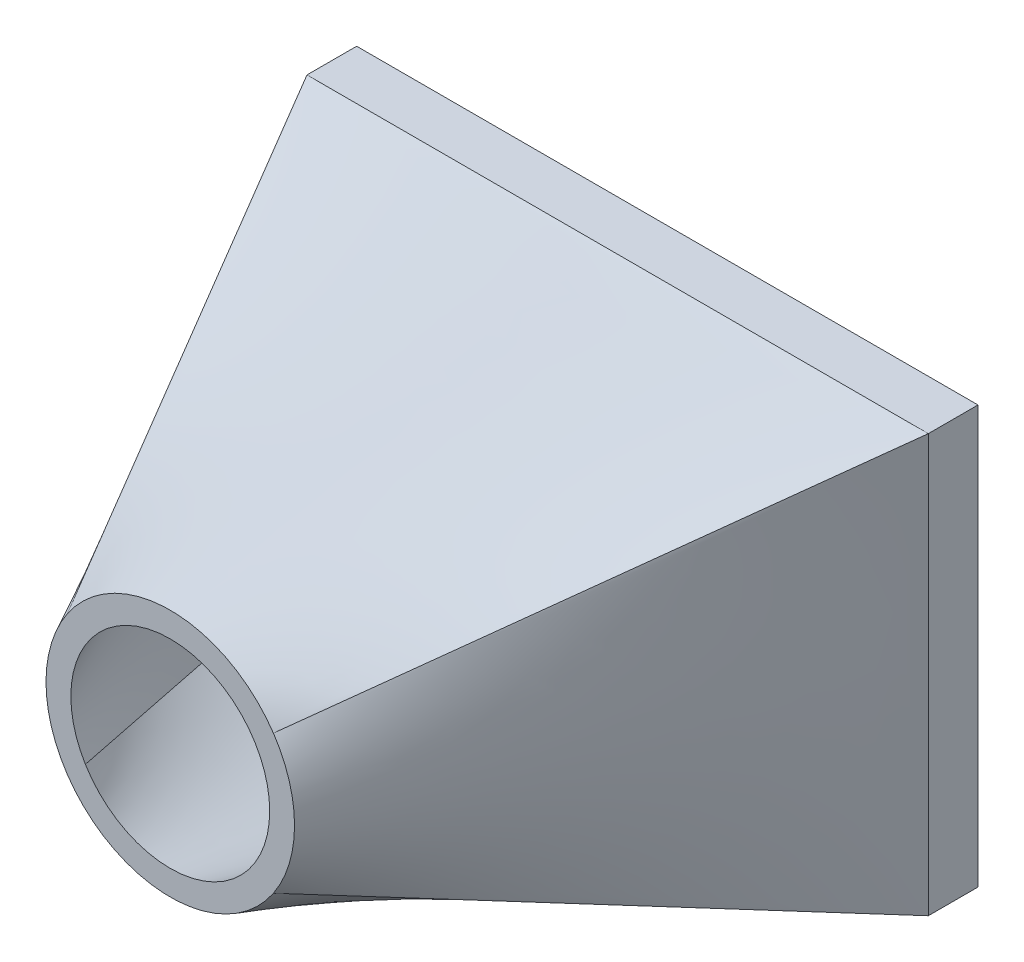
ISO-10303-21;
HEADER;
FILE_DESCRIPTION(('STEP AP214'),'2;1');
FILE_NAME('part.step','',(''),(''),'','','');
FILE_SCHEMA(('AUTOMOTIVE_DESIGN { 1 0 10303 214 1 1 1 1 }'));
ENDSEC;
DATA;
#1=APPLICATION_CONTEXT('core data for automotive mechanical design processes');
#2=APPLICATION_PROTOCOL_DEFINITION('international standard','automotive_design',2000,#1);
#3=PRODUCT_CONTEXT('',#1,'mechanical');
#4=PRODUCT('Part','Part','',(#3));
#5=PRODUCT_RELATED_PRODUCT_CATEGORY('part','',(#4));
#6=PRODUCT_DEFINITION_FORMATION('','',#4);
#7=PRODUCT_DEFINITION_CONTEXT('part definition',#1,'design');
#8=PRODUCT_DEFINITION('design','',#6,#7);
#9=PRODUCT_DEFINITION_SHAPE('','',#8);
#10=(LENGTH_UNIT() NAMED_UNIT(*) SI_UNIT(.MILLI.,.METRE.));
#11=(NAMED_UNIT(*) PLANE_ANGLE_UNIT() SI_UNIT($,.RADIAN.));
#12=(NAMED_UNIT(*) SI_UNIT($,.STERADIAN.) SOLID_ANGLE_UNIT());
#13=UNCERTAINTY_MEASURE_WITH_UNIT(LENGTH_MEASURE(1.E-05),#10,'distance_accuracy_value','');
#14=(GEOMETRIC_REPRESENTATION_CONTEXT(3) GLOBAL_UNCERTAINTY_ASSIGNED_CONTEXT((#13)) GLOBAL_UNIT_ASSIGNED_CONTEXT((#10,
#11,#12)) REPRESENTATION_CONTEXT('',''));
#15=CARTESIAN_POINT('',(0.,0.,0.));
#16=DIRECTION('',(0.,0.,1.));
#17=DIRECTION('',(1.,0.,0.));
#18=AXIS2_PLACEMENT_3D('',#15,#16,#17);
#19=CARTESIAN_POINT('',(0.,0.,0.));
#20=DIRECTION('',(0.,0.,1.));
#21=DIRECTION('',(1.,0.,0.));
#22=AXIS2_PLACEMENT_3D('',#19,#20,#21);
#23=PLANE('',#22);
#24=DIRECTION('',(1.,0.,0.));
#25=VECTOR('',#24,1.);
#26=CARTESIAN_POINT('',(-6.25,-4.2,0.));
#27=LINE('',#26,#25);
#28=CARTESIAN_POINT('',(-6.25,-4.2,0.));
#29=VERTEX_POINT('',#28);
#30=CARTESIAN_POINT('',(6.25,-4.2,0.));
#31=VERTEX_POINT('',#30);
#32=EDGE_CURVE('E370',#29,#31,#27,.T.);
#33=ORIENTED_EDGE('',*,*,#32,.F.);
#34=DIRECTION('',(0.,-1.,0.));
#35=VECTOR('',#34,1.);
#36=CARTESIAN_POINT('',(-6.25,-4.2,0.));
#37=LINE('',#36,#35);
#38=CARTESIAN_POINT('',(-6.25,4.2,0.));
#39=VERTEX_POINT('',#38);
#40=EDGE_CURVE('E427',#39,#29,#37,.T.);
#41=ORIENTED_EDGE('',*,*,#40,.F.);
#42=DIRECTION('',(-1.,0.,0.));
#43=VECTOR('',#42,1.);
#44=CARTESIAN_POINT('',(-6.25,4.2,0.));
#45=LINE('',#44,#43);
#46=CARTESIAN_POINT('',(6.25,4.2,0.));
#47=VERTEX_POINT('',#46);
#48=EDGE_CURVE('E424',#47,#39,#45,.T.);
#49=ORIENTED_EDGE('',*,*,#48,.F.);
#50=DIRECTION('',(0.,1.,0.));
#51=VECTOR('',#50,1.);
#52=CARTESIAN_POINT('',(6.25,-4.2,0.));
#53=LINE('',#52,#51);
#54=EDGE_CURVE('E156',#31,#47,#53,.T.);
#55=ORIENTED_EDGE('',*,*,#54,.F.);
#56=EDGE_LOOP('',(#33,#41,#49,#55));
#57=FACE_BOUND('',#56,.T.);
#58=DIRECTION('',(0.,1.,0.));
#59=VECTOR('',#58,1.);
#60=CARTESIAN_POINT('',(5.25,-3.2,0.));
#61=LINE('',#60,#59);
#62=CARTESIAN_POINT('',(5.25,-3.2,0.));
#63=VERTEX_POINT('',#62);
#64=CARTESIAN_POINT('',(5.25,3.2,0.));
#65=VERTEX_POINT('',#64);
#66=EDGE_CURVE('E401',#63,#65,#61,.T.);
#67=ORIENTED_EDGE('',*,*,#66,.T.);
#68=DIRECTION('',(-1.,0.,0.));
#69=VECTOR('',#68,1.);
#70=CARTESIAN_POINT('',(-5.25,3.2,0.));
#71=LINE('',#70,#69);
#72=CARTESIAN_POINT('',(-5.25,3.2,0.));
#73=VERTEX_POINT('',#72);
#74=EDGE_CURVE('E406',#65,#73,#71,.T.);
#75=ORIENTED_EDGE('',*,*,#74,.T.);
#76=DIRECTION('',(0.,-1.,0.));
#77=VECTOR('',#76,1.);
#78=CARTESIAN_POINT('',(-5.25,-3.2,0.));
#79=LINE('',#78,#77);
#80=CARTESIAN_POINT('',(-5.25,-3.2,0.));
#81=VERTEX_POINT('',#80);
#82=EDGE_CURVE('E409',#73,#81,#79,.T.);
#83=ORIENTED_EDGE('',*,*,#82,.T.);
#84=DIRECTION('',(1.,0.,0.));
#85=VECTOR('',#84,1.);
#86=CARTESIAN_POINT('',(-5.25,-3.2,0.));
#87=LINE('',#86,#85);
#88=EDGE_CURVE('E416',#81,#63,#87,.T.);
#89=ORIENTED_EDGE('',*,*,#88,.T.);
#90=EDGE_LOOP('',(#67,#75,#83,#89));
#91=FACE_BOUND('',#90,.T.);
#92=ADVANCED_FACE('F97',(#57,#91),#23,.F.);
#93=CARTESIAN_POINT('',(-6.25,-4.2,1.));
#94=DIRECTION('',(0.,1.,0.));
#95=DIRECTION('',(0.,0.,1.));
#96=AXIS2_PLACEMENT_3D('',#93,#94,#95);
#97=PLANE('',#96);
#98=ORIENTED_EDGE('',*,*,#32,.T.);
#99=DIRECTION('',(0.,0.,-1.));
#100=VECTOR('',#99,1.);
#101=CARTESIAN_POINT('',(6.25,-4.2,1.));
#102=LINE('',#101,#100);
#103=CARTESIAN_POINT('',(6.25,-4.2,1.));
#104=VERTEX_POINT('',#103);
#105=EDGE_CURVE('E12',#104,#31,#102,.T.);
#106=ORIENTED_EDGE('',*,*,#105,.F.);
#107=DIRECTION('',(1.,0.,0.));
#108=VECTOR('',#107,1.);
#109=CARTESIAN_POINT('',(-6.25,-4.2,1.));
#110=LINE('',#109,#108);
#111=CARTESIAN_POINT('',(-6.25,-4.2,1.));
#112=VERTEX_POINT('',#111);
#113=EDGE_CURVE('E185',#112,#104,#110,.T.);
#114=ORIENTED_EDGE('',*,*,#113,.F.);
#115=DIRECTION('',(0.,0.,-1.));
#116=VECTOR('',#115,1.);
#117=CARTESIAN_POINT('',(-6.25,-4.2,1.));
#118=LINE('',#117,#116);
#119=EDGE_CURVE('E431',#112,#29,#118,.T.);
#120=ORIENTED_EDGE('',*,*,#119,.T.);
#121=EDGE_LOOP('',(#98,#106,#114,#120));
#122=FACE_BOUND('',#121,.T.);
#123=ADVANCED_FACE('F99',(#122),#97,.F.);
#124=CARTESIAN_POINT('',(6.25,-4.2,1.));
#125=DIRECTION('',(-1.,0.,0.));
#126=DIRECTION('',(0.,0.,1.));
#127=AXIS2_PLACEMENT_3D('',#124,#125,#126);
#128=PLANE('',#127);
#129=ORIENTED_EDGE('',*,*,#54,.T.);
#130=DIRECTION('',(0.,0.,-1.));
#131=VECTOR('',#130,1.);
#132=CARTESIAN_POINT('',(6.25,4.2,1.));
#133=LINE('',#132,#131);
#134=CARTESIAN_POINT('',(6.25,4.2,0.999999999999999));
#135=VERTEX_POINT('',#134);
#136=EDGE_CURVE('E109',#135,#47,#133,.T.);
#137=ORIENTED_EDGE('',*,*,#136,.F.);
#138=DIRECTION('',(0.,1.,0.));
#139=VECTOR('',#138,1.);
#140=CARTESIAN_POINT('',(6.25,-4.2,1.));
#141=LINE('',#140,#139);
#142=EDGE_CURVE('E152',#104,#135,#141,.T.);
#143=ORIENTED_EDGE('',*,*,#142,.F.);
#144=ORIENTED_EDGE('',*,*,#105,.T.);
#145=EDGE_LOOP('',(#129,#137,#143,#144));
#146=FACE_BOUND('',#145,.T.);
#147=ADVANCED_FACE('F150',(#146),#128,.F.);
#148=CARTESIAN_POINT('',(-6.25,4.2,1.));
#149=DIRECTION('',(0.,-1.,0.));
#150=DIRECTION('',(0.,0.,-1.));
#151=AXIS2_PLACEMENT_3D('',#148,#149,#150);
#152=PLANE('',#151);
#153=ORIENTED_EDGE('',*,*,#48,.T.);
#154=DIRECTION('',(0.,0.,-1.));
#155=VECTOR('',#154,1.);
#156=CARTESIAN_POINT('',(-6.25,4.2,1.));
#157=LINE('',#156,#155);
#158=CARTESIAN_POINT('',(-6.25,4.2,1.));
#159=VERTEX_POINT('',#158);
#160=EDGE_CURVE('E161',#159,#39,#157,.T.);
#161=ORIENTED_EDGE('',*,*,#160,.F.);
#162=DIRECTION('',(1.,0.,0.));
#163=VECTOR('',#162,1.);
#164=CARTESIAN_POINT('',(-6.25,4.2,1.));
#165=LINE('',#164,#163);
#166=EDGE_CURVE('E164',#135,#159,#165,.F.);
#167=ORIENTED_EDGE('',*,*,#166,.F.);
#168=ORIENTED_EDGE('',*,*,#136,.T.);
#169=EDGE_LOOP('',(#153,#161,#167,#168));
#170=FACE_BOUND('',#169,.T.);
#171=ADVANCED_FACE('F165',(#170),#152,.F.);
#172=CARTESIAN_POINT('',(-6.25,-4.2,1.));
#173=DIRECTION('',(1.,0.,0.));
#174=DIRECTION('',(0.,0.,-1.));
#175=AXIS2_PLACEMENT_3D('',#172,#173,#174);
#176=PLANE('',#175);
#177=ORIENTED_EDGE('',*,*,#40,.T.);
#178=ORIENTED_EDGE('',*,*,#119,.F.);
#179=DIRECTION('',(0.,1.,0.));
#180=VECTOR('',#179,1.);
#181=CARTESIAN_POINT('',(-6.25,-4.2,1.));
#182=LINE('',#181,#180);
#183=EDGE_CURVE('E173',#159,#112,#182,.F.);
#184=ORIENTED_EDGE('',*,*,#183,.F.);
#185=ORIENTED_EDGE('',*,*,#160,.T.);
#186=EDGE_LOOP('',(#177,#178,#184,#185));
#187=FACE_BOUND('',#186,.T.);
#188=ADVANCED_FACE('F480',(#187),#176,.F.);
#189=CARTESIAN_POINT('',(5.25,-3.2,1.));
#190=DIRECTION('',(-1.,0.,0.));
#191=DIRECTION('',(0.,0.,1.));
#192=AXIS2_PLACEMENT_3D('',#189,#190,#191);
#193=PLANE('',#192);
#194=ORIENTED_EDGE('',*,*,#66,.F.);
#195=DIRECTION('',(0.,0.,-1.));
#196=VECTOR('',#195,1.);
#197=CARTESIAN_POINT('',(5.25,-3.2,1.));
#198=LINE('',#197,#196);
#199=CARTESIAN_POINT('',(5.25,-3.2,1.));
#200=VERTEX_POINT('',#199);
#201=EDGE_CURVE('E325',#200,#63,#198,.T.);
#202=ORIENTED_EDGE('',*,*,#201,.F.);
#203=CARTESIAN_POINT('',(5.25,3.2,1.));
#204=CARTESIAN_POINT('',(5.25,2.66666666666667,1.));
#205=CARTESIAN_POINT('',(5.25,2.13333333333333,1.));
#206=CARTESIAN_POINT('',(5.25,1.06666666666667,1.));
#207=CARTESIAN_POINT('',(5.25,0.533333333333335,1.));
#208=CARTESIAN_POINT('',(5.25,-0.533333333333332,1.));
#209=CARTESIAN_POINT('',(5.25,-1.06666666666666,1.));
#210=CARTESIAN_POINT('',(5.25,-2.13333333333333,1.));
#211=CARTESIAN_POINT('',(5.25,-2.66666666666667,1.));
#212=CARTESIAN_POINT('',(5.25,-3.2,1.));
#213=B_SPLINE_CURVE_WITH_KNOTS('',3,(#203,#204,#205,#206,#207,#208,#209,#210,#211,#212),
.UNSPECIFIED.,.F.,.F.,(4,2,2,2,4),(0.,0.25,0.5,0.75,1.),.UNSPECIFIED.);
#214=CARTESIAN_POINT('',(5.25,3.2,1.));
#215=VERTEX_POINT('',#214);
#216=EDGE_CURVE('E379',#200,#215,#213,.F.);
#217=ORIENTED_EDGE('',*,*,#216,.T.);
#218=DIRECTION('',(0.,0.,-1.));
#219=VECTOR('',#218,1.);
#220=CARTESIAN_POINT('',(5.25,3.2,1.));
#221=LINE('',#220,#219);
#222=EDGE_CURVE('E361',#215,#65,#221,.T.);
#223=ORIENTED_EDGE('',*,*,#222,.T.);
#224=EDGE_LOOP('',(#194,#202,#217,#223));
#225=FACE_BOUND('',#224,.T.);
#226=ADVANCED_FACE('F351',(#225),#193,.T.);
#227=CARTESIAN_POINT('',(-5.25,3.2,1.));
#228=DIRECTION('',(0.,-1.,0.));
#229=DIRECTION('',(0.,0.,-1.));
#230=AXIS2_PLACEMENT_3D('',#227,#228,#229);
#231=PLANE('',#230);
#232=ORIENTED_EDGE('',*,*,#74,.F.);
#233=ORIENTED_EDGE('',*,*,#222,.F.);
#234=CARTESIAN_POINT('',(-5.25,3.2,1.));
#235=CARTESIAN_POINT('',(-4.8125,3.2,1.));
#236=CARTESIAN_POINT('',(-4.375,3.2,1.));
#237=CARTESIAN_POINT('',(-3.5,3.2,1.));
#238=CARTESIAN_POINT('',(-3.0625,3.2,1.));
#239=CARTESIAN_POINT('',(-2.1875,3.2,1.));
#240=CARTESIAN_POINT('',(-1.75,3.2,1.));
#241=CARTESIAN_POINT('',(-0.874999999999995,3.2,1.));
#242=CARTESIAN_POINT('',(-0.437499999999995,3.2,1.));
#243=CARTESIAN_POINT('',(0.437500000000005,3.2,1.));
#244=CARTESIAN_POINT('',(0.875000000000004,3.2,1.));
#245=CARTESIAN_POINT('',(1.75,3.2,1.));
#246=CARTESIAN_POINT('',(2.1875,3.2,1.));
#247=CARTESIAN_POINT('',(3.0625,3.2,1.));
#248=CARTESIAN_POINT('',(3.5,3.2,1.));
#249=CARTESIAN_POINT('',(4.375,3.2,1.));
#250=CARTESIAN_POINT('',(4.8125,3.2,1.));
#251=CARTESIAN_POINT('',(5.25,3.2,1.));
#252=B_SPLINE_CURVE_WITH_KNOTS('',3,(#234,#235,#236,#237,#238,#239,#240,#241,#242,#243,#244,
#245,#246,#247,#248,#249,#250,#251),.UNSPECIFIED.,.F.,.F.,(4,2,2,2,2,2,2,2,4),(0.,0.125,0.25,
0.375,0.5,0.625,0.75,0.875,1.),.UNSPECIFIED.);
#253=CARTESIAN_POINT('',(-5.25,3.2,1.));
#254=VERTEX_POINT('',#253);
#255=EDGE_CURVE('E596',#215,#254,#252,.F.);
#256=ORIENTED_EDGE('',*,*,#255,.T.);
#257=DIRECTION('',(0.,0.,-1.));
#258=VECTOR('',#257,1.);
#259=CARTESIAN_POINT('',(-5.25,3.2,1.));
#260=LINE('',#259,#258);
#261=EDGE_CURVE('E324',#254,#73,#260,.T.);
#262=ORIENTED_EDGE('',*,*,#261,.T.);
#263=EDGE_LOOP('',(#232,#233,#256,#262));
#264=FACE_BOUND('',#263,.T.);
#265=ADVANCED_FACE('F347',(#264),#231,.T.);
#266=CARTESIAN_POINT('',(-5.25,-3.2,1.));
#267=DIRECTION('',(1.,0.,0.));
#268=DIRECTION('',(0.,0.,-1.));
#269=AXIS2_PLACEMENT_3D('',#266,#267,#268);
#270=PLANE('',#269);
#271=ORIENTED_EDGE('',*,*,#82,.F.);
#272=ORIENTED_EDGE('',*,*,#261,.F.);
#273=CARTESIAN_POINT('',(-5.25,-3.2,1.));
#274=CARTESIAN_POINT('',(-5.25,-2.66666666666667,1.));
#275=CARTESIAN_POINT('',(-5.25,-2.13333333333334,1.));
#276=CARTESIAN_POINT('',(-5.25,-1.06666666666668,1.));
#277=CARTESIAN_POINT('',(-5.25,-0.533333333333351,1.));
#278=CARTESIAN_POINT('',(-5.25,0.533333333333316,1.));
#279=CARTESIAN_POINT('',(-5.25,1.06666666666665,1.));
#280=CARTESIAN_POINT('',(-5.25,2.13333333333332,1.));
#281=CARTESIAN_POINT('',(-5.25,2.66666666666666,1.));
#282=CARTESIAN_POINT('',(-5.25,3.2,1.));
#283=B_SPLINE_CURVE_WITH_KNOTS('',3,(#273,#274,#275,#276,#277,#278,#279,#280,#281,#282),
.UNSPECIFIED.,.F.,.F.,(4,2,2,2,4),(0.,0.25,0.5,0.75,1.),.UNSPECIFIED.);
#284=CARTESIAN_POINT('',(-5.25,-3.2,1.));
#285=VERTEX_POINT('',#284);
#286=EDGE_CURVE('E333',#254,#285,#283,.F.);
#287=ORIENTED_EDGE('',*,*,#286,.T.);
#288=DIRECTION('',(0.,0.,-1.));
#289=VECTOR('',#288,1.);
#290=CARTESIAN_POINT('',(-5.25,-3.2,1.));
#291=LINE('',#290,#289);
#292=EDGE_CURVE('E320',#285,#81,#291,.T.);
#293=ORIENTED_EDGE('',*,*,#292,.T.);
#294=EDGE_LOOP('',(#271,#272,#287,#293));
#295=FACE_BOUND('',#294,.T.);
#296=ADVANCED_FACE('F338',(#295),#270,.T.);
#297=CARTESIAN_POINT('',(-5.25,-3.2,1.));
#298=DIRECTION('',(0.,1.,0.));
#299=DIRECTION('',(0.,0.,1.));
#300=AXIS2_PLACEMENT_3D('',#297,#298,#299);
#301=PLANE('',#300);
#302=ORIENTED_EDGE('',*,*,#88,.F.);
#303=ORIENTED_EDGE('',*,*,#292,.F.);
#304=CARTESIAN_POINT('',(5.25,-3.2,1.));
#305=CARTESIAN_POINT('',(4.8125,-3.2,1.));
#306=CARTESIAN_POINT('',(4.375,-3.2,1.));
#307=CARTESIAN_POINT('',(3.5,-3.2,1.));
#308=CARTESIAN_POINT('',(3.0625,-3.2,1.));
#309=CARTESIAN_POINT('',(2.1875,-3.2,1.));
#310=CARTESIAN_POINT('',(1.75,-3.2,1.));
#311=CARTESIAN_POINT('',(0.875000000000002,-3.2,1.));
#312=CARTESIAN_POINT('',(0.437500000000001,-3.2,1.));
#313=CARTESIAN_POINT('',(-0.437499999999999,-3.2,1.));
#314=CARTESIAN_POINT('',(-0.874999999999998,-3.2,1.));
#315=CARTESIAN_POINT('',(-1.75,-3.2,1.));
#316=CARTESIAN_POINT('',(-2.1875,-3.2,1.));
#317=CARTESIAN_POINT('',(-3.0625,-3.2,1.));
#318=CARTESIAN_POINT('',(-3.5,-3.2,1.));
#319=CARTESIAN_POINT('',(-4.375,-3.2,1.));
#320=CARTESIAN_POINT('',(-4.8125,-3.2,1.));
#321=CARTESIAN_POINT('',(-5.25,-3.2,1.));
#322=B_SPLINE_CURVE_WITH_KNOTS('',3,(#304,#305,#306,#307,#308,#309,#310,#311,#312,#313,#314,
#315,#316,#317,#318,#319,#320,#321),.UNSPECIFIED.,.F.,.F.,(4,2,2,2,2,2,2,2,4),(0.,0.125,0.25,
0.375,0.5,0.625,0.75,0.875,1.),.UNSPECIFIED.);
#323=EDGE_CURVE('E126',#285,#200,#322,.F.);
#324=ORIENTED_EDGE('',*,*,#323,.T.);
#325=ORIENTED_EDGE('',*,*,#201,.T.);
#326=EDGE_LOOP('',(#302,#303,#324,#325));
#327=FACE_BOUND('',#326,.T.);
#328=ADVANCED_FACE('F239',(#327),#301,.T.);
#329=CARTESIAN_POINT('',(0.,0.,10.));
#330=DIRECTION('',(0.,0.,1.));
#331=DIRECTION('',(1.,0.,0.));
#332=AXIS2_PLACEMENT_3D('',#329,#330,#331);
#333=PLANE('',#332);
#334=CARTESIAN_POINT('',(0.,0.,10.));
#335=DIRECTION('',(0.,0.,1.));
#336=DIRECTION('',(1.,0.,0.));
#337=AXIS2_PLACEMENT_3D('',#334,#335,#336);
#338=CIRCLE('',#337,2.);
#339=CARTESIAN_POINT('',(-1.70776865476249,-1.04092565623618,10.));
#340=VERTEX_POINT('',#339);
#341=CARTESIAN_POINT('',(1.70776865476249,-1.04092565623618,10.));
#342=VERTEX_POINT('',#341);
#343=EDGE_CURVE('E294',#340,#342,#338,.T.);
#344=ORIENTED_EDGE('',*,*,#343,.F.);
#345=CARTESIAN_POINT('',(-1.70776865476249,1.04092565623618,10.));
#346=VERTEX_POINT('',#345);
#347=EDGE_CURVE('E308',#346,#340,#338,.T.);
#348=ORIENTED_EDGE('',*,*,#347,.F.);
#349=CARTESIAN_POINT('',(1.70776865476249,1.04092565623618,10.));
#350=VERTEX_POINT('',#349);
#351=EDGE_CURVE('E298',#350,#346,#338,.T.);
#352=ORIENTED_EDGE('',*,*,#351,.F.);
#353=EDGE_CURVE('E307',#342,#350,#338,.T.);
#354=ORIENTED_EDGE('',*,*,#353,.F.);
#355=EDGE_LOOP('',(#344,#348,#352,#354));
#356=FACE_BOUND('',#355,.T.);
#357=CARTESIAN_POINT('',(0.,0.,10.));
#358=DIRECTION('',(0.,0.,1.));
#359=DIRECTION('',(1.,0.,0.));
#360=AXIS2_PLACEMENT_3D('',#357,#358,#359);
#361=CIRCLE('',#360,2.5);
#362=CARTESIAN_POINT('',(2.07500392425113,1.39440263709676,10.));
#363=VERTEX_POINT('',#362);
#364=CARTESIAN_POINT('',(-2.07500392425113,1.39440263709676,10.));
#365=VERTEX_POINT('',#364);
#366=EDGE_CURVE('E189',#363,#365,#361,.T.);
#367=ORIENTED_EDGE('',*,*,#366,.T.);
#368=CARTESIAN_POINT('',(-2.07500392425113,-1.39440263709676,10.));
#369=VERTEX_POINT('',#368);
#370=EDGE_CURVE('E411',#365,#369,#361,.T.);
#371=ORIENTED_EDGE('',*,*,#370,.T.);
#372=CARTESIAN_POINT('',(2.07500392425113,-1.39440263709676,10.));
#373=VERTEX_POINT('',#372);
#374=EDGE_CURVE('E197',#369,#373,#361,.T.);
#375=ORIENTED_EDGE('',*,*,#374,.T.);
#376=EDGE_CURVE('E193',#373,#363,#361,.T.);
#377=ORIENTED_EDGE('',*,*,#376,.T.);
#378=EDGE_LOOP('',(#367,#371,#375,#377));
#379=FACE_BOUND('',#378,.T.);
#380=ADVANCED_FACE('F230',(#356,#379),#333,.T.);
#381=CARTESIAN_POINT('',(-6.25,4.2,1.));
#382=CARTESIAN_POINT('',(-2.07500392425113,1.39440263709676,10.));
#383=CARTESIAN_POINT('',(-6.25,3.5,1.));
#384=CARTESIAN_POINT('',(-2.20462783854063,1.2015099074993,10.));
#385=CARTESIAN_POINT('',(-6.25,2.8,1.));
#386=CARTESIAN_POINT('',(-2.31257792315013,0.981630687979022,10.));
#387=CARTESIAN_POINT('',(-6.25,1.4,1.));
#388=CARTESIAN_POINT('',(-2.46045502288664,0.507716986691863,10.));
#389=CARTESIAN_POINT('',(-6.25,0.699999999999998,1.));
#390=CARTESIAN_POINT('',(-2.5,0.253989333521903,10.));
#391=CARTESIAN_POINT('',(-6.25,-0.700000000000002,1.));
#392=CARTESIAN_POINT('',(-2.5,-0.253989333521902,10.));
#393=CARTESIAN_POINT('',(-6.25,-1.4,1.));
#394=CARTESIAN_POINT('',(-2.46045502288664,-0.507716986691863,10.));
#395=CARTESIAN_POINT('',(-6.25,-2.8,1.));
#396=CARTESIAN_POINT('',(-2.31257792315013,-0.981630687979021,10.));
#397=CARTESIAN_POINT('',(-6.25,-3.5,1.));
#398=CARTESIAN_POINT('',(-2.20462783854063,-1.2015099074993,10.));
#399=CARTESIAN_POINT('',(-6.25,-4.2,1.));
#400=CARTESIAN_POINT('',(-2.07500392425113,-1.39440263709676,10.));
#401=B_SPLINE_SURFACE_WITH_KNOTS('',3,1,((#381,#382),(#383,#384),(#385,#386),(#387,#388),(#389,
#390),(#391,#392),(#393,#394),(#395,#396),(#397,#398),(#399,#400)),.UNSPECIFIED.,.F.,.F.,.F.,(4,
2,2,2,4),(2,2),(0.,0.25,0.5,0.75,1.),(0.,1.),.UNSPECIFIED.);
#402=DIRECTION('',(0.404935094672259,0.272116383619758,0.872914797026877));
#403=VECTOR('',#402,1.);
#404=CARTESIAN_POINT('',(-4.16250196212557,-2.79720131854838,5.5));
#405=LINE('',#404,#403);
#406=EDGE_CURVE('E199',#112,#369,#405,.T.);
#407=DIRECTION('',(-0.404935094672259,0.272116383619758,-0.872914797026877));
#408=VECTOR('',#407,1.);
#409=CARTESIAN_POINT('',(-4.16250196212557,2.79720131854838,5.5));
#410=LINE('',#409,#408);
#411=EDGE_CURVE('E492',#365,#159,#410,.T.);
#412=ORIENTED_EDGE('',*,*,#183,.T.);
#413=ORIENTED_EDGE('',*,*,#406,.T.);
#414=ORIENTED_EDGE('',*,*,#370,.F.);
#415=ORIENTED_EDGE('',*,*,#411,.T.);
#416=EDGE_LOOP('',(#412,#413,#414,#415));
#417=FACE_BOUND('',#416,.T.);
#418=ADVANCED_FACE('F238',(#417),#401,.T.);
#419=CARTESIAN_POINT('',(-6.25,-4.2,1.));
#420=CARTESIAN_POINT('',(-2.07500392425113,-1.39440263709676,10.));
#421=CARTESIAN_POINT('',(-5.72916666666667,-4.2,1.));
#422=CARTESIAN_POINT('',(-1.9785575594524,-1.53792401328535,10.));
#423=CARTESIAN_POINT('',(-5.20833333333333,-4.2,1.));
#424=CARTESIAN_POINT('',(-1.86164323960616,-1.67956315420566,10.));
#425=CARTESIAN_POINT('',(-4.16666666666666,-4.2,1.));
#426=CARTESIAN_POINT('',(-1.58421408968886,-1.94342832606914,10.));
#427=CARTESIAN_POINT('',(-3.64583333333333,-4.2,1.));
#428=CARTESIAN_POINT('',(-1.42358774096064,-2.06551906767005,10.));
#429=CARTESIAN_POINT('',(-2.60416666666666,-4.2,1.));
#430=CARTESIAN_POINT('',(-1.06394815175803,-2.27178022825551,10.));
#431=CARTESIAN_POINT('',(-2.08333333333333,-4.2,1.));
#432=CARTESIAN_POINT('',(-0.864940413432553,-2.35572953861995,10.));
#433=CARTESIAN_POINT('',(-1.04166666666666,-4.2,1.));
#434=CARTESIAN_POINT('',(-0.443879209340652,-2.46993012561703,10.));
#435=CARTESIAN_POINT('',(-0.520833333333327,-4.2,1.));
#436=CARTESIAN_POINT('',(-0.222007082730027,-2.5,10.));
#437=CARTESIAN_POINT('',(0.520833333333339,-4.2,1.));
#438=CARTESIAN_POINT('',(0.222007082730025,-2.5,10.));
#439=CARTESIAN_POINT('',(1.04166666666667,-4.2,1.));
#440=CARTESIAN_POINT('',(0.44387920934065,-2.46993012561703,10.));
#441=CARTESIAN_POINT('',(2.08333333333334,-4.2,1.));
#442=CARTESIAN_POINT('',(0.864940413432551,-2.35572953861995,10.));
#443=CARTESIAN_POINT('',(2.60416666666667,-4.2,1.));
#444=CARTESIAN_POINT('',(1.06394815175803,-2.27178022825551,10.));
#445=CARTESIAN_POINT('',(3.64583333333334,-4.2,1.));
#446=CARTESIAN_POINT('',(1.42358774096064,-2.06551906767005,10.));
#447=CARTESIAN_POINT('',(4.16666666666667,-4.2,1.));
#448=CARTESIAN_POINT('',(1.58421408968886,-1.94342832606914,10.));
#449=CARTESIAN_POINT('',(5.20833333333333,-4.2,1.));
#450=CARTESIAN_POINT('',(1.86164323960616,-1.67956315420567,10.));
#451=CARTESIAN_POINT('',(5.72916666666667,-4.2,1.));
#452=CARTESIAN_POINT('',(1.9785575594524,-1.53792401328535,10.));
#453=CARTESIAN_POINT('',(6.25,-4.2,1.));
#454=CARTESIAN_POINT('',(2.07500392425113,-1.39440263709676,10.));
#455=B_SPLINE_SURFACE_WITH_KNOTS('',3,1,((#419,#420),(#421,#422),(#423,#424),(#425,#426),(#427,
#428),(#429,#430),(#431,#432),(#433,#434),(#435,#436),(#437,#438),(#439,#440),(#441,#442),(#443,
#444),(#445,#446),(#447,#448),(#449,#450),(#451,#452),(#453,#454)),.UNSPECIFIED.,.F.,.F.,.F.,(4,
2,2,2,2,2,2,2,4),(2,2),(0.,0.125,0.25,0.375,0.5,0.625,0.75,0.875,1.),(0.,1.),.UNSPECIFIED.);
#456=DIRECTION('',(-0.404935094672259,0.272116383619758,0.872914797026877));
#457=VECTOR('',#456,1.);
#458=CARTESIAN_POINT('',(4.16250196212557,-2.79720131854838,5.5));
#459=LINE('',#458,#457);
#460=EDGE_CURVE('E183',#104,#373,#459,.T.);
#461=ORIENTED_EDGE('',*,*,#113,.T.);
#462=ORIENTED_EDGE('',*,*,#460,.T.);
#463=ORIENTED_EDGE('',*,*,#374,.F.);
#464=ORIENTED_EDGE('',*,*,#406,.F.);
#465=EDGE_LOOP('',(#461,#462,#463,#464));
#466=FACE_BOUND('',#465,.T.);
#467=ADVANCED_FACE('F486',(#466),#455,.T.);
#468=CARTESIAN_POINT('',(6.25,4.2,1.));
#469=CARTESIAN_POINT('',(2.07500392425113,1.39440263709676,10.));
#470=CARTESIAN_POINT('',(5.72916666666666,4.2,1.));
#471=CARTESIAN_POINT('',(1.9785575594524,1.53792401328535,10.));
#472=CARTESIAN_POINT('',(5.20833333333333,4.2,1.));
#473=CARTESIAN_POINT('',(1.86164323960616,1.67956315420567,10.));
#474=CARTESIAN_POINT('',(4.16666666666666,4.2,1.));
#475=CARTESIAN_POINT('',(1.58421408968886,1.94342832606914,10.));
#476=CARTESIAN_POINT('',(3.64583333333333,4.2,1.));
#477=CARTESIAN_POINT('',(1.42358774096064,2.06551906767005,10.));
#478=CARTESIAN_POINT('',(2.60416666666666,4.2,1.));
#479=CARTESIAN_POINT('',(1.06394815175803,2.27178022825551,10.));
#480=CARTESIAN_POINT('',(2.08333333333332,4.2,1.));
#481=CARTESIAN_POINT('',(0.864940413432553,2.35572953861995,10.));
#482=CARTESIAN_POINT('',(1.04166666666666,4.2,1.));
#483=CARTESIAN_POINT('',(0.443879209340652,2.46993012561703,10.));
#484=CARTESIAN_POINT('',(0.520833333333323,4.2,1.));
#485=CARTESIAN_POINT('',(0.222007082730026,2.5,10.));
#486=CARTESIAN_POINT('',(-0.520833333333344,4.2,1.));
#487=CARTESIAN_POINT('',(-0.222007082730026,2.5,10.));
#488=CARTESIAN_POINT('',(-1.04166666666668,4.2,1.));
#489=CARTESIAN_POINT('',(-0.443879209340651,2.46993012561703,10.));
#490=CARTESIAN_POINT('',(-2.08333333333334,4.2,1.));
#491=CARTESIAN_POINT('',(-0.864940413432553,2.35572953861995,10.));
#492=CARTESIAN_POINT('',(-2.60416666666668,4.2,1.));
#493=CARTESIAN_POINT('',(-1.06394815175803,2.27178022825551,10.));
#494=CARTESIAN_POINT('',(-3.64583333333334,4.2,1.));
#495=CARTESIAN_POINT('',(-1.42358774096064,2.06551906767005,10.));
#496=CARTESIAN_POINT('',(-4.16666666666667,4.2,1.));
#497=CARTESIAN_POINT('',(-1.58421408968886,1.94342832606914,10.));
#498=CARTESIAN_POINT('',(-5.20833333333334,4.2,1.));
#499=CARTESIAN_POINT('',(-1.86164323960616,1.67956315420567,10.));
#500=CARTESIAN_POINT('',(-5.72916666666667,4.2,1.));
#501=CARTESIAN_POINT('',(-1.9785575594524,1.53792401328535,10.));
#502=CARTESIAN_POINT('',(-6.25,4.2,1.));
#503=CARTESIAN_POINT('',(-2.07500392425113,1.39440263709676,10.));
#504=B_SPLINE_SURFACE_WITH_KNOTS('',3,1,((#468,#469),(#470,#471),(#472,#473),(#474,#475),(#476,
#477),(#478,#479),(#480,#481),(#482,#483),(#484,#485),(#486,#487),(#488,#489),(#490,#491),(#492,
#493),(#494,#495),(#496,#497),(#498,#499),(#500,#501),(#502,#503)),.UNSPECIFIED.,.F.,.F.,.F.,(4,
2,2,2,2,2,2,2,4),(2,2),(0.,0.125,0.25,0.375,0.5,0.625,0.75,0.875,1.),(0.,1.),.UNSPECIFIED.);
#505=DIRECTION('',(-0.404935094672259,-0.272116383619758,0.872914797026877));
#506=VECTOR('',#505,1.);
#507=CARTESIAN_POINT('',(4.16250196212557,2.79720131854838,5.5));
#508=LINE('',#507,#506);
#509=EDGE_CURVE('E180',#135,#363,#508,.T.);
#510=ORIENTED_EDGE('',*,*,#166,.T.);
#511=ORIENTED_EDGE('',*,*,#411,.F.);
#512=ORIENTED_EDGE('',*,*,#366,.F.);
#513=ORIENTED_EDGE('',*,*,#509,.F.);
#514=EDGE_LOOP('',(#510,#511,#512,#513));
#515=FACE_BOUND('',#514,.T.);
#516=ADVANCED_FACE('F187',(#515),#504,.T.);
#517=CARTESIAN_POINT('',(6.25,-4.2,1.));
#518=CARTESIAN_POINT('',(2.07500392425113,-1.39440263709676,10.));
#519=CARTESIAN_POINT('',(6.25,-3.5,1.));
#520=CARTESIAN_POINT('',(2.20462783854062,-1.2015099074993,10.));
#521=CARTESIAN_POINT('',(6.25,-2.8,1.));
#522=CARTESIAN_POINT('',(2.31257792315013,-0.981630687979023,10.));
#523=CARTESIAN_POINT('',(6.25,-1.39999999999999,1.));
#524=CARTESIAN_POINT('',(2.46045502288664,-0.507716986691864,10.));
#525=CARTESIAN_POINT('',(6.25,-0.699999999999993,1.));
#526=CARTESIAN_POINT('',(2.5,-0.253989333521903,10.));
#527=CARTESIAN_POINT('',(6.25,0.700000000000007,1.));
#528=CARTESIAN_POINT('',(2.5,0.253989333521902,10.));
#529=CARTESIAN_POINT('',(6.25,1.40000000000001,1.));
#530=CARTESIAN_POINT('',(2.46045502288664,0.507716986691863,10.));
#531=CARTESIAN_POINT('',(6.25,2.8,1.));
#532=CARTESIAN_POINT('',(2.31257792315013,0.981630687979023,10.));
#533=CARTESIAN_POINT('',(6.25,3.5,1.));
#534=CARTESIAN_POINT('',(2.20462783854063,1.2015099074993,10.));
#535=CARTESIAN_POINT('',(6.25,4.2,1.));
#536=CARTESIAN_POINT('',(2.07500392425113,1.39440263709676,10.));
#537=B_SPLINE_SURFACE_WITH_KNOTS('',3,1,((#517,#518),(#519,#520),(#521,#522),(#523,#524),(#525,
#526),(#527,#528),(#529,#530),(#531,#532),(#533,#534),(#535,#536)),.UNSPECIFIED.,.F.,.F.,.F.,(4,
2,2,2,4),(2,2),(0.,0.25,0.5,0.75,1.),(0.,1.),.UNSPECIFIED.);
#538=ORIENTED_EDGE('',*,*,#142,.T.);
#539=ORIENTED_EDGE('',*,*,#509,.T.);
#540=ORIENTED_EDGE('',*,*,#376,.F.);
#541=ORIENTED_EDGE('',*,*,#460,.F.);
#542=EDGE_LOOP('',(#538,#539,#540,#541));
#543=FACE_BOUND('',#542,.T.);
#544=ADVANCED_FACE('F178',(#543),#537,.T.);
#545=CARTESIAN_POINT('',(1.70776865476249,-1.04092565623618,10.));
#546=CARTESIAN_POINT('',(5.25,-3.2,1.));
#547=CARTESIAN_POINT('',(1.63369947944339,-1.16244539699407,10.));
#548=CARTESIAN_POINT('',(4.8125,-3.2,1.));
#549=CARTESIAN_POINT('',(1.54200887562624,-1.28354475003521,10.));
#550=CARTESIAN_POINT('',(4.375,-3.2,1.));
#551=CARTESIAN_POINT('',(1.31984948990967,-1.51105123071265,10.));
#552=CARTESIAN_POINT('',(3.5,-3.2,1.));
#553=CARTESIAN_POINT('',(1.18925611135401,-1.6173367152245,10.));
#554=CARTESIAN_POINT('',(3.0625,-3.2,1.));
#555=CARTESIAN_POINT('',(0.892947871945789,-1.79798560806073,10.));
#556=CARTESIAN_POINT('',(2.1875,-3.2,1.));
#557=CARTESIAN_POINT('',(0.727221120097388,-1.87212470991405,10.));
#558=CARTESIAN_POINT('',(1.75,-3.2,1.));
#559=CARTESIAN_POINT('',(0.374256765069914,-1.97322917087344,10.));
#560=CARTESIAN_POINT('',(0.875000000000002,-3.2,1.));
#561=CARTESIAN_POINT('',(0.187198334522502,-2.,10.));
#562=CARTESIAN_POINT('',(0.437500000000001,-3.2,1.));
#563=CARTESIAN_POINT('',(-0.187198334522503,-2.,10.));
#564=CARTESIAN_POINT('',(-0.437499999999999,-3.2,1.));
#565=CARTESIAN_POINT('',(-0.374256765069916,-1.97322917087344,10.));
#566=CARTESIAN_POINT('',(-0.874999999999998,-3.2,1.));
#567=CARTESIAN_POINT('',(-0.727221120097389,-1.87212470991405,10.));
#568=CARTESIAN_POINT('',(-1.75,-3.2,1.));
#569=CARTESIAN_POINT('',(-0.892947871945791,-1.79798560806073,10.));
#570=CARTESIAN_POINT('',(-2.1875,-3.2,1.));
#571=CARTESIAN_POINT('',(-1.18925611135401,-1.6173367152245,10.));
#572=CARTESIAN_POINT('',(-3.0625,-3.2,1.));
#573=CARTESIAN_POINT('',(-1.31984948990967,-1.51105123071265,10.));
#574=CARTESIAN_POINT('',(-3.5,-3.2,1.));
#575=CARTESIAN_POINT('',(-1.54200887562624,-1.28354475003521,10.));
#576=CARTESIAN_POINT('',(-4.375,-3.2,1.));
#577=CARTESIAN_POINT('',(-1.63369947944339,-1.16244539699407,10.));
#578=CARTESIAN_POINT('',(-4.8125,-3.2,1.));
#579=CARTESIAN_POINT('',(-1.70776865476249,-1.04092565623618,10.));
#580=CARTESIAN_POINT('',(-5.25,-3.2,1.));
#581=B_SPLINE_SURFACE_WITH_KNOTS('',3,1,((#545,#546),(#547,#548),(#549,#550),(#551,#552),(#553,
#554),(#555,#556),(#557,#558),(#559,#560),(#561,#562),(#563,#564),(#565,#566),(#567,#568),(#569,
#570),(#571,#572),(#573,#574),(#575,#576),(#577,#578),(#579,#580)),.UNSPECIFIED.,.F.,.F.,.F.,(4,
2,2,2,2,2,2,2,4),(2,2),(0.,0.125,0.25,0.375,0.5,0.625,0.75,0.875,1.),(0.,1.),.UNSPECIFIED.);
#582=DIRECTION('',(-0.357438448602177,0.21786724486228,0.908169377967011));
#583=VECTOR('',#582,1.);
#584=CARTESIAN_POINT('',(3.47888432738124,-2.12046282811809,5.5));
#585=LINE('',#584,#583);
#586=EDGE_CURVE('E571',#200,#342,#585,.T.);
#587=DIRECTION('',(-0.357438448602178,-0.21786724486228,-0.908169377967011));
#588=VECTOR('',#587,1.);
#589=CARTESIAN_POINT('',(-3.47888432738124,-2.12046282811809,5.5));
#590=LINE('',#589,#588);
#591=EDGE_CURVE('E580',#340,#285,#590,.T.);
#592=ORIENTED_EDGE('',*,*,#343,.T.);
#593=ORIENTED_EDGE('',*,*,#586,.F.);
#594=ORIENTED_EDGE('',*,*,#323,.F.);
#595=ORIENTED_EDGE('',*,*,#591,.F.);
#596=EDGE_LOOP('',(#592,#593,#594,#595));
#597=FACE_BOUND('',#596,.T.);
#598=ADVANCED_FACE('F225',(#597),#581,.F.);
#599=CARTESIAN_POINT('',(-1.70776865476249,-1.04092565623618,10.));
#600=CARTESIAN_POINT('',(-5.25,-3.2,1.));
#601=CARTESIAN_POINT('',(-1.79806250658005,-0.892787305597997,10.));
#602=CARTESIAN_POINT('',(-5.25,-2.66666666666667,1.));
#603=CARTESIAN_POINT('',(-1.8721740679458,-0.727085204231007,10.));
#604=CARTESIAN_POINT('',(-5.25,-2.13333333333334,1.));
#605=CARTESIAN_POINT('',(-1.97323997264687,-0.374182636220544,10.));
#606=CARTESIAN_POINT('',(-5.25,-1.06666666666668,1.));
#607=CARTESIAN_POINT('',(-2.,-0.187161201818629,10.));
#608=CARTESIAN_POINT('',(-5.25,-0.533333333333351,1.));
#609=CARTESIAN_POINT('',(-2.,0.187161201818629,10.));
#610=CARTESIAN_POINT('',(-5.25,0.533333333333316,1.));
#611=CARTESIAN_POINT('',(-1.97323997264687,0.374182636220545,10.));
#612=CARTESIAN_POINT('',(-5.25,1.06666666666665,1.));
#613=CARTESIAN_POINT('',(-1.8721740679458,0.727085204231007,10.));
#614=CARTESIAN_POINT('',(-5.25,2.13333333333332,1.));
#615=CARTESIAN_POINT('',(-1.79806250658005,0.892787305597997,10.));
#616=CARTESIAN_POINT('',(-5.25,2.66666666666666,1.));
#617=CARTESIAN_POINT('',(-1.70776865476249,1.04092565623618,10.));
#618=CARTESIAN_POINT('',(-5.25,3.2,1.));
#619=B_SPLINE_SURFACE_WITH_KNOTS('',3,1,((#599,#600),(#601,#602),(#603,#604),(#605,#606),(#607,
#608),(#609,#610),(#611,#612),(#613,#614),(#615,#616),(#617,#618)),.UNSPECIFIED.,.F.,.F.,.F.,(4,
2,2,2,4),(2,2),(0.,0.25,0.5,0.75,1.),(0.,1.),.UNSPECIFIED.);
#620=DIRECTION('',(-0.357438448602178,0.21786724486228,-0.908169377967011));
#621=VECTOR('',#620,1.);
#622=CARTESIAN_POINT('',(-3.47888432738124,2.12046282811809,5.5));
#623=LINE('',#622,#621);
#624=EDGE_CURVE('E450',#346,#254,#623,.T.);
#625=ORIENTED_EDGE('',*,*,#347,.T.);
#626=ORIENTED_EDGE('',*,*,#591,.T.);
#627=ORIENTED_EDGE('',*,*,#286,.F.);
#628=ORIENTED_EDGE('',*,*,#624,.F.);
#629=EDGE_LOOP('',(#625,#626,#627,#628));
#630=FACE_BOUND('',#629,.T.);
#631=ADVANCED_FACE('F520',(#630),#619,.F.);
#632=CARTESIAN_POINT('',(1.70776865476249,1.04092565623618,10.));
#633=CARTESIAN_POINT('',(5.25,3.2,1.));
#634=CARTESIAN_POINT('',(1.79806250658005,0.892787305597997,10.));
#635=CARTESIAN_POINT('',(5.25,2.66666666666667,1.));
#636=CARTESIAN_POINT('',(1.8721740679458,0.727085204231008,10.));
#637=CARTESIAN_POINT('',(5.25,2.13333333333333,1.));
#638=CARTESIAN_POINT('',(1.97323997264686,0.374182636220545,10.));
#639=CARTESIAN_POINT('',(5.25,1.06666666666667,1.));
#640=CARTESIAN_POINT('',(2.,0.187161201818629,10.));
#641=CARTESIAN_POINT('',(5.25,0.533333333333335,1.));
#642=CARTESIAN_POINT('',(2.,-0.187161201818629,10.));
#643=CARTESIAN_POINT('',(5.25,-0.533333333333332,1.));
#644=CARTESIAN_POINT('',(1.97323997264686,-0.374182636220545,10.));
#645=CARTESIAN_POINT('',(5.25,-1.06666666666666,1.));
#646=CARTESIAN_POINT('',(1.8721740679458,-0.727085204231008,10.));
#647=CARTESIAN_POINT('',(5.25,-2.13333333333333,1.));
#648=CARTESIAN_POINT('',(1.79806250658005,-0.892787305597998,10.));
#649=CARTESIAN_POINT('',(5.25,-2.66666666666667,1.));
#650=CARTESIAN_POINT('',(1.70776865476249,-1.04092565623618,10.));
#651=CARTESIAN_POINT('',(5.25,-3.2,1.));
#652=B_SPLINE_SURFACE_WITH_KNOTS('',3,1,((#632,#633),(#634,#635),(#636,#637),(#638,#639),(#640,
#641),(#642,#643),(#644,#645),(#646,#647),(#648,#649),(#650,#651)),.UNSPECIFIED.,.F.,.F.,.F.,(4,
2,2,2,4),(2,2),(0.,0.25,0.5,0.75,1.),(0.,1.),.UNSPECIFIED.);
#653=DIRECTION('',(0.357438448602177,0.21786724486228,-0.908169377967011));
#654=VECTOR('',#653,1.);
#655=CARTESIAN_POINT('',(3.47888432738124,2.12046282811809,5.5));
#656=LINE('',#655,#654);
#657=EDGE_CURVE('E117',#350,#215,#656,.T.);
#658=ORIENTED_EDGE('',*,*,#353,.T.);
#659=ORIENTED_EDGE('',*,*,#657,.T.);
#660=ORIENTED_EDGE('',*,*,#216,.F.);
#661=ORIENTED_EDGE('',*,*,#586,.T.);
#662=EDGE_LOOP('',(#658,#659,#660,#661));
#663=FACE_BOUND('',#662,.T.);
#664=ADVANCED_FACE('F508',(#663),#652,.F.);
#665=CARTESIAN_POINT('',(-1.70776865476249,1.04092565623618,10.));
#666=CARTESIAN_POINT('',(-5.25,3.2,1.));
#667=CARTESIAN_POINT('',(-1.63369947944339,1.16244539699407,10.));
#668=CARTESIAN_POINT('',(-4.8125,3.2,1.));
#669=CARTESIAN_POINT('',(-1.54200887562624,1.28354475003521,10.));
#670=CARTESIAN_POINT('',(-4.375,3.2,1.));
#671=CARTESIAN_POINT('',(-1.31984948990967,1.51105123071265,10.));
#672=CARTESIAN_POINT('',(-3.5,3.2,1.));
#673=CARTESIAN_POINT('',(-1.18925611135401,1.6173367152245,10.));
#674=CARTESIAN_POINT('',(-3.0625,3.2,1.));
#675=CARTESIAN_POINT('',(-0.89294787194579,1.79798560806073,10.));
#676=CARTESIAN_POINT('',(-2.1875,3.2,1.));
#677=CARTESIAN_POINT('',(-0.727221120097388,1.87212470991405,10.));
#678=CARTESIAN_POINT('',(-1.75,3.2,1.));
#679=CARTESIAN_POINT('',(-0.374256765069915,1.97322917087344,10.));
#680=CARTESIAN_POINT('',(-0.874999999999995,3.2,1.));
#681=CARTESIAN_POINT('',(-0.187198334522503,2.,10.));
#682=CARTESIAN_POINT('',(-0.437499999999995,3.2,1.));
#683=CARTESIAN_POINT('',(0.187198334522503,2.,10.));
#684=CARTESIAN_POINT('',(0.437500000000005,3.2,1.));
#685=CARTESIAN_POINT('',(0.374256765069915,1.97322917087344,10.));
#686=CARTESIAN_POINT('',(0.875000000000004,3.2,1.));
#687=CARTESIAN_POINT('',(0.727221120097388,1.87212470991405,10.));
#688=CARTESIAN_POINT('',(1.75,3.2,1.));
#689=CARTESIAN_POINT('',(0.89294787194579,1.79798560806073,10.));
#690=CARTESIAN_POINT('',(2.1875,3.2,1.));
#691=CARTESIAN_POINT('',(1.18925611135401,1.6173367152245,10.));
#692=CARTESIAN_POINT('',(3.0625,3.2,1.));
#693=CARTESIAN_POINT('',(1.31984948990967,1.51105123071265,10.));
#694=CARTESIAN_POINT('',(3.5,3.2,1.));
#695=CARTESIAN_POINT('',(1.54200887562624,1.28354475003521,10.));
#696=CARTESIAN_POINT('',(4.375,3.2,1.));
#697=CARTESIAN_POINT('',(1.63369947944339,1.16244539699407,10.));
#698=CARTESIAN_POINT('',(4.8125,3.2,1.));
#699=CARTESIAN_POINT('',(1.70776865476249,1.04092565623618,10.));
#700=CARTESIAN_POINT('',(5.25,3.2,1.));
#701=B_SPLINE_SURFACE_WITH_KNOTS('',3,1,((#665,#666),(#667,#668),(#669,#670),(#671,#672),(#673,
#674),(#675,#676),(#677,#678),(#679,#680),(#681,#682),(#683,#684),(#685,#686),(#687,#688),(#689,
#690),(#691,#692),(#693,#694),(#695,#696),(#697,#698),(#699,#700)),.UNSPECIFIED.,.F.,.F.,.F.,(4,
2,2,2,2,2,2,2,4),(2,2),(0.,0.125,0.25,0.375,0.5,0.625,0.75,0.875,1.),(0.,1.),.UNSPECIFIED.);
#702=ORIENTED_EDGE('',*,*,#351,.T.);
#703=ORIENTED_EDGE('',*,*,#624,.T.);
#704=ORIENTED_EDGE('',*,*,#255,.F.);
#705=ORIENTED_EDGE('',*,*,#657,.F.);
#706=EDGE_LOOP('',(#702,#703,#704,#705));
#707=FACE_BOUND('',#706,.T.);
#708=ADVANCED_FACE('F448',(#707),#701,.F.);
#709=CLOSED_SHELL('',(#92,#123,#147,#171,#188,#226,#265,#296,#328,#380,#418,#467,#516,#544,#598,
#631,#664,#708));
#710=MANIFOLD_SOLID_BREP('B2',#709);
#711=ADVANCED_BREP_SHAPE_REPRESENTATION('',(#18,#710),#14);
#712=SHAPE_DEFINITION_REPRESENTATION(#9,#711);
ENDSEC;
END-ISO-10303-21;
